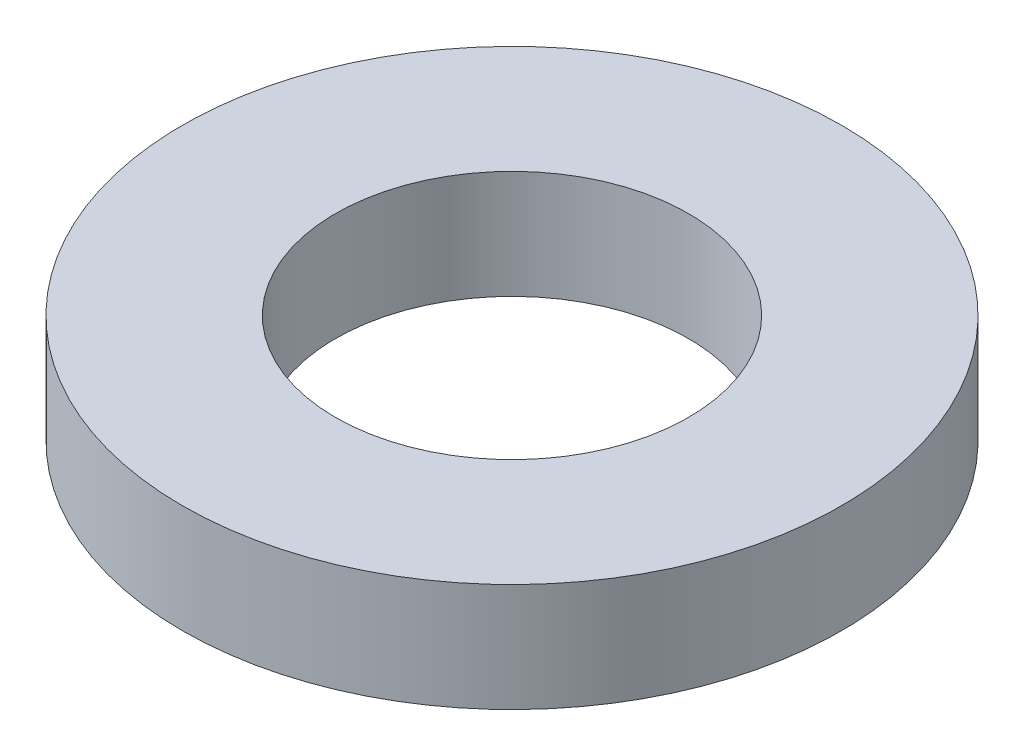
ISO-10303-21;
HEADER;
FILE_DESCRIPTION(('STEP AP214'),'2;1');
FILE_NAME('part.step','',(''),(''),'','','');
FILE_SCHEMA(('AUTOMOTIVE_DESIGN { 1 0 10303 214 1 1 1 1 }'));
ENDSEC;
DATA;
#1=APPLICATION_CONTEXT('core data for automotive mechanical design processes');
#2=APPLICATION_PROTOCOL_DEFINITION('international standard','automotive_design',2000,#1);
#3=PRODUCT_CONTEXT('',#1,'mechanical');
#4=PRODUCT('Part','Part','',(#3));
#5=PRODUCT_RELATED_PRODUCT_CATEGORY('part','',(#4));
#6=PRODUCT_DEFINITION_FORMATION('','',#4);
#7=PRODUCT_DEFINITION_CONTEXT('part definition',#1,'design');
#8=PRODUCT_DEFINITION('design','',#6,#7);
#9=PRODUCT_DEFINITION_SHAPE('','',#8);
#10=(LENGTH_UNIT() NAMED_UNIT(*) SI_UNIT(.MILLI.,.METRE.));
#11=(NAMED_UNIT(*) PLANE_ANGLE_UNIT() SI_UNIT($,.RADIAN.));
#12=(NAMED_UNIT(*) SI_UNIT($,.STERADIAN.) SOLID_ANGLE_UNIT());
#13=UNCERTAINTY_MEASURE_WITH_UNIT(LENGTH_MEASURE(1.E-05),#10,'distance_accuracy_value','');
#14=(GEOMETRIC_REPRESENTATION_CONTEXT(3) GLOBAL_UNCERTAINTY_ASSIGNED_CONTEXT((#13)) GLOBAL_UNIT_ASSIGNED_CONTEXT((#10,
#11,#12)) REPRESENTATION_CONTEXT('',''));
#15=CARTESIAN_POINT('',(0.,0.,0.));
#16=DIRECTION('',(0.,0.,1.));
#17=DIRECTION('',(1.,0.,0.));
#18=AXIS2_PLACEMENT_3D('',#15,#16,#17);
#19=CARTESIAN_POINT('',(0.,23.,0.));
#20=DIRECTION('',(0.,-1.,0.));
#21=DIRECTION('',(0.,0.,-1.));
#22=AXIS2_PLACEMENT_3D('',#19,#20,#21);
#23=CYLINDRICAL_SURFACE('',#22,70.);
#24=CARTESIAN_POINT('',(0.,23.,0.));
#25=DIRECTION('',(0.,1.,0.));
#26=DIRECTION('',(0.,0.,1.));
#27=AXIS2_PLACEMENT_3D('',#24,#25,#26);
#28=CIRCLE('',#27,70.);
#29=CARTESIAN_POINT('',(0.,23.,70.));
#30=VERTEX_POINT('',#29);
#31=EDGE_CURVE('E10',#30,#30,#28,.T.);
#32=ORIENTED_EDGE('',*,*,#31,.F.);
#33=EDGE_LOOP('',(#32));
#34=FACE_BOUND('',#33,.T.);
#35=CARTESIAN_POINT('',(0.,0.,0.));
#36=DIRECTION('',(0.,1.,0.));
#37=DIRECTION('',(0.,0.,1.));
#38=AXIS2_PLACEMENT_3D('',#35,#36,#37);
#39=CIRCLE('',#38,70.);
#40=CARTESIAN_POINT('',(0.,0.,70.));
#41=VERTEX_POINT('',#40);
#42=EDGE_CURVE('E37',#41,#41,#39,.T.);
#43=ORIENTED_EDGE('',*,*,#42,.T.);
#44=EDGE_LOOP('',(#43));
#45=FACE_BOUND('',#44,.T.);
#46=ADVANCED_FACE('F40',(#34,#45),#23,.T.);
#47=CARTESIAN_POINT('',(0.,23.,0.));
#48=DIRECTION('',(0.,1.,0.));
#49=DIRECTION('',(0.,0.,1.));
#50=AXIS2_PLACEMENT_3D('',#47,#48,#49);
#51=PLANE('',#50);
#52=CARTESIAN_POINT('',(0.,23.,0.));
#53=DIRECTION('',(0.,1.,0.));
#54=DIRECTION('',(0.,0.,1.));
#55=AXIS2_PLACEMENT_3D('',#52,#53,#54);
#56=CIRCLE('',#55,37.5);
#57=CARTESIAN_POINT('',(0.,23.,37.5));
#58=VERTEX_POINT('',#57);
#59=EDGE_CURVE('E50',#58,#58,#56,.T.);
#60=ORIENTED_EDGE('',*,*,#59,.F.);
#61=EDGE_LOOP('',(#60));
#62=FACE_BOUND('',#61,.T.);
#63=ORIENTED_EDGE('',*,*,#31,.T.);
#64=EDGE_LOOP('',(#63));
#65=FACE_BOUND('',#64,.T.);
#66=ADVANCED_FACE('F59',(#62,#65),#51,.T.);
#67=CARTESIAN_POINT('',(0.,0.,0.));
#68=DIRECTION('',(0.,1.,0.));
#69=DIRECTION('',(0.,0.,1.));
#70=AXIS2_PLACEMENT_3D('',#67,#68,#69);
#71=PLANE('',#70);
#72=CARTESIAN_POINT('',(0.,0.,0.));
#73=DIRECTION('',(0.,1.,0.));
#74=DIRECTION('',(0.,0.,1.));
#75=AXIS2_PLACEMENT_3D('',#72,#73,#74);
#76=CIRCLE('',#75,37.5);
#77=CARTESIAN_POINT('',(0.,0.,37.5));
#78=VERTEX_POINT('',#77);
#79=EDGE_CURVE('E47',#78,#78,#76,.T.);
#80=ORIENTED_EDGE('',*,*,#79,.T.);
#81=EDGE_LOOP('',(#80));
#82=FACE_BOUND('',#81,.T.);
#83=ORIENTED_EDGE('',*,*,#42,.F.);
#84=EDGE_LOOP('',(#83));
#85=FACE_BOUND('',#84,.T.);
#86=ADVANCED_FACE('F58',(#82,#85),#71,.F.);
#87=CARTESIAN_POINT('',(0.,23.,0.));
#88=DIRECTION('',(0.,-1.,0.));
#89=DIRECTION('',(0.,0.,-1.));
#90=AXIS2_PLACEMENT_3D('',#87,#88,#89);
#91=CYLINDRICAL_SURFACE('',#90,37.5);
#92=ORIENTED_EDGE('',*,*,#59,.T.);
#93=EDGE_LOOP('',(#92));
#94=FACE_BOUND('',#93,.T.);
#95=ORIENTED_EDGE('',*,*,#79,.F.);
#96=EDGE_LOOP('',(#95));
#97=FACE_BOUND('',#96,.T.);
#98=ADVANCED_FACE('F54',(#94,#97),#91,.F.);
#99=CLOSED_SHELL('',(#46,#66,#86,#98));
#100=MANIFOLD_SOLID_BREP('B2',#99);
#101=ADVANCED_BREP_SHAPE_REPRESENTATION('',(#18,#100),#14);
#102=SHAPE_DEFINITION_REPRESENTATION(#9,#101);
ENDSEC;
END-ISO-10303-21;
